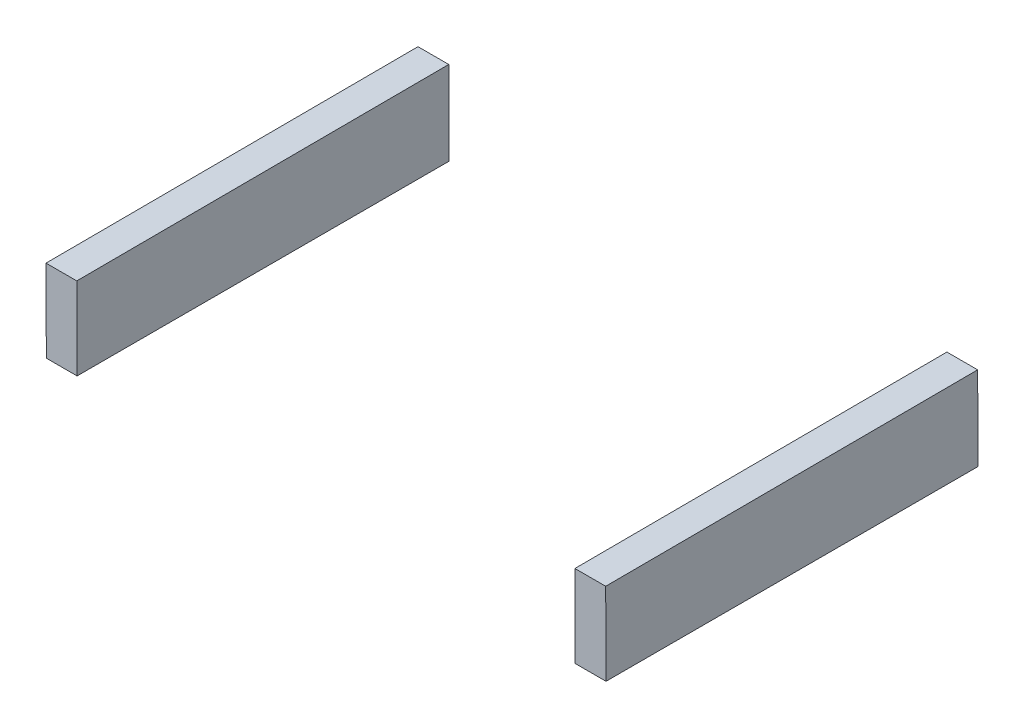
ISO-10303-21;
HEADER;
FILE_DESCRIPTION(('STEP AP214'),'2;1');
FILE_NAME('part.step','',(''),(''),'','','');
FILE_SCHEMA(('AUTOMOTIVE_DESIGN { 1 0 10303 214 1 1 1 1 }'));
ENDSEC;
DATA;
#1=APPLICATION_CONTEXT('core data for automotive mechanical design processes');
#2=APPLICATION_PROTOCOL_DEFINITION('international standard','automotive_design',2000,#1);
#3=PRODUCT_CONTEXT('',#1,'mechanical');
#4=PRODUCT('Part','Part','',(#3));
#5=PRODUCT_RELATED_PRODUCT_CATEGORY('part','',(#4));
#6=PRODUCT_DEFINITION_FORMATION('','',#4);
#7=PRODUCT_DEFINITION_CONTEXT('part definition',#1,'design');
#8=PRODUCT_DEFINITION('design','',#6,#7);
#9=PRODUCT_DEFINITION_SHAPE('','',#8);
#10=(LENGTH_UNIT() NAMED_UNIT(*) SI_UNIT(.MILLI.,.METRE.));
#11=(NAMED_UNIT(*) PLANE_ANGLE_UNIT() SI_UNIT($,.RADIAN.));
#12=(NAMED_UNIT(*) SI_UNIT($,.STERADIAN.) SOLID_ANGLE_UNIT());
#13=UNCERTAINTY_MEASURE_WITH_UNIT(LENGTH_MEASURE(1.E-05),#10,'distance_accuracy_value','');
#14=(GEOMETRIC_REPRESENTATION_CONTEXT(3) GLOBAL_UNCERTAINTY_ASSIGNED_CONTEXT((#13)) GLOBAL_UNIT_ASSIGNED_CONTEXT((#10,
#11,#12)) REPRESENTATION_CONTEXT('',''));
#15=CARTESIAN_POINT('',(0.,0.,0.));
#16=DIRECTION('',(0.,0.,1.));
#17=DIRECTION('',(1.,0.,0.));
#18=AXIS2_PLACEMENT_3D('',#15,#16,#17);
#19=CARTESIAN_POINT('',(0.,71.1662208241946,0.278618565381096));
#20=DIRECTION('',(0.,0.999992336320967,0.00391500949342411));
#21=DIRECTION('',(0.,-0.00391500949342411,0.999992336320967));
#22=AXIS2_PLACEMENT_3D('',#19,#20,#21);
#23=PLANE('',#22);
#24=DIRECTION('',(0.,-0.00391500949342411,0.999992336320967));
#25=VECTOR('',#24,1.);
#26=CARTESIAN_POINT('',(108.267412509275,69.0845166715377,531.998452869963));
#27=LINE('',#26,#25);
#28=CARTESIAN_POINT('',(108.267412509275,69.6049098906345,399.076877112803));
#29=VERTEX_POINT('',#28);
#30=CARTESIAN_POINT('',(108.267412509275,69.0845166715377,531.998452869963));
#31=VERTEX_POINT('',#30);
#32=EDGE_CURVE('E93',#29,#31,#27,.T.);
#33=ORIENTED_EDGE('',*,*,#32,.F.);
#34=DIRECTION('',(1.,0.,0.));
#35=VECTOR('',#34,1.);
#36=CARTESIAN_POINT('',(108.267412509275,69.6049098906345,399.076877112803));
#37=LINE('',#36,#35);
#38=CARTESIAN_POINT('',(97.267412509275,69.6049098906345,399.076877112803));
#39=VERTEX_POINT('',#38);
#40=EDGE_CURVE('E104',#39,#29,#37,.T.);
#41=ORIENTED_EDGE('',*,*,#40,.F.);
#42=DIRECTION('',(0.,0.00391500949342411,-0.999992336320967));
#43=VECTOR('',#42,1.);
#44=CARTESIAN_POINT('',(97.2674125092749,69.0845166715377,531.998452869963));
#45=LINE('',#44,#43);
#46=CARTESIAN_POINT('',(97.2674125092749,69.0845166715377,531.998452869963));
#47=VERTEX_POINT('',#46);
#48=EDGE_CURVE('E95',#47,#39,#45,.T.);
#49=ORIENTED_EDGE('',*,*,#48,.F.);
#50=DIRECTION('',(-1.,0.,0.));
#51=VECTOR('',#50,1.);
#52=CARTESIAN_POINT('',(108.267412509275,69.0845166715377,531.998452869963));
#53=LINE('',#52,#51);
#54=EDGE_CURVE('E85',#31,#47,#53,.T.);
#55=ORIENTED_EDGE('',*,*,#54,.F.);
#56=EDGE_LOOP('',(#33,#41,#49,#55));
#57=FACE_BOUND('',#56,.T.);
#58=ADVANCED_FACE('F43',(#57),#23,.T.);
#59=CARTESIAN_POINT('',(108.267412509275,-93.5115477863383,398.438269738382));
#60=DIRECTION('',(0.,-0.0039150094934241,0.999992336320967));
#61=DIRECTION('',(0.,-0.999992336320967,-0.0039150094934241));
#62=AXIS2_PLACEMENT_3D('',#59,#60,#61);
#63=PLANE('',#62);
#64=DIRECTION('',(0.,0.999992336320967,0.0039150094934241));
#65=VECTOR('',#64,1.);
#66=CARTESIAN_POINT('',(108.267412509275,-93.5115477863383,398.438269738382));
#67=LINE('',#66,#65);
#68=CARTESIAN_POINT('',(108.267412509275,39.6047144668189,398.9594251628));
#69=VERTEX_POINT('',#68);
#70=EDGE_CURVE('E98',#69,#29,#67,.T.);
#71=ORIENTED_EDGE('',*,*,#70,.F.);
#72=DIRECTION('',(-1.,0.,0.));
#73=VECTOR('',#72,1.);
#74=CARTESIAN_POINT('',(108.267412509275,39.6047144668189,398.9594251628));
#75=LINE('',#74,#73);
#76=CARTESIAN_POINT('',(97.267412509275,39.6047144668189,398.9594251628));
#77=VERTEX_POINT('',#76);
#78=EDGE_CURVE('E47',#69,#77,#75,.T.);
#79=ORIENTED_EDGE('',*,*,#78,.T.);
#80=DIRECTION('',(0.,0.999992336320967,0.0039150094934241));
#81=VECTOR('',#80,1.);
#82=CARTESIAN_POINT('',(97.267412509275,-93.5115477863383,398.438269738382));
#83=LINE('',#82,#81);
#84=EDGE_CURVE('E107',#77,#39,#83,.T.);
#85=ORIENTED_EDGE('',*,*,#84,.T.);
#86=ORIENTED_EDGE('',*,*,#40,.T.);
#87=EDGE_LOOP('',(#71,#79,#85,#86));
#88=FACE_BOUND('',#87,.T.);
#89=ADVANCED_FACE('F116',(#88),#63,.F.);
#90=CARTESIAN_POINT('',(97.2674125092749,-94.031941005435,531.359845495542));
#91=DIRECTION('',(1.,0.,0.));
#92=DIRECTION('',(0.,0.,-1.));
#93=AXIS2_PLACEMENT_3D('',#90,#91,#92);
#94=PLANE('',#93);
#95=ORIENTED_EDGE('',*,*,#84,.F.);
#96=DIRECTION('',(0.,0.,1.));
#97=VECTOR('',#96,1.);
#98=CARTESIAN_POINT('',(97.2674125092749,39.6047144668189,531.359845495542));
#99=LINE('',#98,#97);
#100=CARTESIAN_POINT('',(97.2674125092749,39.6047144668189,531.883038279967));
#101=VERTEX_POINT('',#100);
#102=EDGE_CURVE('E113',#77,#101,#99,.T.);
#103=ORIENTED_EDGE('',*,*,#102,.T.);
#104=DIRECTION('',(0.,0.999992336320967,0.0039150094934241));
#105=VECTOR('',#104,1.);
#106=CARTESIAN_POINT('',(97.2674125092749,-94.031941005435,531.359845495542));
#107=LINE('',#106,#105);
#108=EDGE_CURVE('E89',#101,#47,#107,.T.);
#109=ORIENTED_EDGE('',*,*,#108,.T.);
#110=ORIENTED_EDGE('',*,*,#48,.T.);
#111=EDGE_LOOP('',(#95,#103,#109,#110));
#112=FACE_BOUND('',#111,.T.);
#113=ADVANCED_FACE('F112',(#112),#94,.F.);
#114=CARTESIAN_POINT('',(108.267412509275,-94.031941005435,531.359845495542));
#115=DIRECTION('',(0.,0.0039150094934241,-0.999992336320967));
#116=DIRECTION('',(0.,0.999992336320967,0.0039150094934241));
#117=AXIS2_PLACEMENT_3D('',#114,#115,#116);
#118=PLANE('',#117);
#119=ORIENTED_EDGE('',*,*,#108,.F.);
#120=DIRECTION('',(1.,0.,0.));
#121=VECTOR('',#120,1.);
#122=CARTESIAN_POINT('',(108.267412509275,39.6047144668189,531.883038279967));
#123=LINE('',#122,#121);
#124=CARTESIAN_POINT('',(108.267412509275,39.6047144668189,531.883038279967));
#125=VERTEX_POINT('',#124);
#126=EDGE_CURVE('E52',#101,#125,#123,.T.);
#127=ORIENTED_EDGE('',*,*,#126,.T.);
#128=DIRECTION('',(0.,0.999992336320967,0.0039150094934241));
#129=VECTOR('',#128,1.);
#130=CARTESIAN_POINT('',(108.267412509275,-94.031941005435,531.359845495542));
#131=LINE('',#130,#129);
#132=EDGE_CURVE('E82',#125,#31,#131,.T.);
#133=ORIENTED_EDGE('',*,*,#132,.T.);
#134=ORIENTED_EDGE('',*,*,#54,.T.);
#135=EDGE_LOOP('',(#119,#127,#133,#134));
#136=FACE_BOUND('',#135,.T.);
#137=ADVANCED_FACE('F84',(#136),#118,.F.);
#138=CARTESIAN_POINT('',(108.267412509275,-94.031941005435,531.359845495542));
#139=DIRECTION('',(-1.,0.,0.));
#140=DIRECTION('',(0.,0.,1.));
#141=AXIS2_PLACEMENT_3D('',#138,#139,#140);
#142=PLANE('',#141);
#143=ORIENTED_EDGE('',*,*,#132,.F.);
#144=DIRECTION('',(0.,0.,-1.));
#145=VECTOR('',#144,1.);
#146=CARTESIAN_POINT('',(108.267412509275,39.6047144668189,531.359845495542));
#147=LINE('',#146,#145);
#148=EDGE_CURVE('E12',#125,#69,#147,.T.);
#149=ORIENTED_EDGE('',*,*,#148,.T.);
#150=ORIENTED_EDGE('',*,*,#70,.T.);
#151=ORIENTED_EDGE('',*,*,#32,.T.);
#152=EDGE_LOOP('',(#143,#149,#150,#151));
#153=FACE_BOUND('',#152,.T.);
#154=ADVANCED_FACE('F45',(#153),#142,.F.);
#155=CARTESIAN_POINT('',(119.23441331911,39.6047144668191,49.1767098548853));
#156=DIRECTION('',(0.,1.,0.));
#157=DIRECTION('',(-1.,0.,0.));
#158=AXIS2_PLACEMENT_3D('',#155,#156,#157);
#159=PLANE('',#158);
#160=ORIENTED_EDGE('',*,*,#126,.F.);
#161=ORIENTED_EDGE('',*,*,#102,.F.);
#162=ORIENTED_EDGE('',*,*,#78,.F.);
#163=ORIENTED_EDGE('',*,*,#148,.F.);
#164=EDGE_LOOP('',(#160,#161,#162,#163));
#165=FACE_BOUND('',#164,.T.);
#166=ADVANCED_FACE('F130',(#165),#159,.F.);
#167=CLOSED_SHELL('',(#58,#89,#113,#137,#154,#166));
#168=MANIFOLD_SOLID_BREP('B2',#167);
#169=CARTESIAN_POINT('',(0.,71.1662208241946,0.278618565381095));
#170=DIRECTION('',(0.,-0.999992336320967,-0.0039150094934241));
#171=DIRECTION('',(0.,0.0039150094934241,-0.999992336320967));
#172=AXIS2_PLACEMENT_3D('',#169,#170,#171);
#173=PLANE('',#172);
#174=DIRECTION('',(0.,0.0039150094934241,-0.999992336320967));
#175=VECTOR('',#174,1.);
#176=CARTESIAN_POINT('',(-91.7325874907251,69.0845166715378,531.998452869963));
#177=LINE('',#176,#175);
#178=CARTESIAN_POINT('',(-91.7325874907251,69.0845166715378,531.998452869963));
#179=VERTEX_POINT('',#178);
#180=CARTESIAN_POINT('',(-91.7325874907251,69.6049098906345,399.076877112803));
#181=VERTEX_POINT('',#180);
#182=EDGE_CURVE('E217',#179,#181,#177,.T.);
#183=ORIENTED_EDGE('',*,*,#182,.F.);
#184=DIRECTION('',(-1.,0.,0.));
#185=VECTOR('',#184,1.);
#186=CARTESIAN_POINT('',(-91.7325874907251,69.0845166715378,531.998452869963));
#187=LINE('',#186,#185);
#188=CARTESIAN_POINT('',(-80.7325874907251,69.0845166715378,531.998452869963));
#189=VERTEX_POINT('',#188);
#190=EDGE_CURVE('E228',#189,#179,#187,.T.);
#191=ORIENTED_EDGE('',*,*,#190,.F.);
#192=DIRECTION('',(0.,-0.0039150094934241,0.999992336320967));
#193=VECTOR('',#192,1.);
#194=CARTESIAN_POINT('',(-80.7325874907251,69.0845166715378,531.998452869963));
#195=LINE('',#194,#193);
#196=CARTESIAN_POINT('',(-80.7325874907251,69.6049098906345,399.076877112803));
#197=VERTEX_POINT('',#196);
#198=EDGE_CURVE('E219',#197,#189,#195,.T.);
#199=ORIENTED_EDGE('',*,*,#198,.F.);
#200=DIRECTION('',(1.,0.,0.));
#201=VECTOR('',#200,1.);
#202=CARTESIAN_POINT('',(-91.7325874907251,69.6049098906345,399.076877112803));
#203=LINE('',#202,#201);
#204=EDGE_CURVE('E209',#181,#197,#203,.T.);
#205=ORIENTED_EDGE('',*,*,#204,.F.);
#206=EDGE_LOOP('',(#183,#191,#199,#205));
#207=FACE_BOUND('',#206,.T.);
#208=ADVANCED_FACE('F167',(#207),#173,.F.);
#209=CARTESIAN_POINT('',(-91.7325874907251,-94.031941005435,531.359845495542));
#210=DIRECTION('',(0.,0.0039150094934241,-0.999992336320967));
#211=DIRECTION('',(0.,0.999992336320967,0.0039150094934241));
#212=AXIS2_PLACEMENT_3D('',#209,#210,#211);
#213=PLANE('',#212);
#214=DIRECTION('',(0.,0.999992336320967,0.0039150094934241));
#215=VECTOR('',#214,1.);
#216=CARTESIAN_POINT('',(-91.7325874907251,-94.031941005435,531.359845495542));
#217=LINE('',#216,#215);
#218=CARTESIAN_POINT('',(-91.7325874907251,39.6047144668188,531.883038279967));
#219=VERTEX_POINT('',#218);
#220=EDGE_CURVE('E222',#219,#179,#217,.T.);
#221=ORIENTED_EDGE('',*,*,#220,.F.);
#222=DIRECTION('',(1.,0.,0.));
#223=VECTOR('',#222,1.);
#224=CARTESIAN_POINT('',(-91.7325874907251,39.6047144668188,531.883038279967));
#225=LINE('',#224,#223);
#226=CARTESIAN_POINT('',(-80.7325874907251,39.6047144668188,531.883038279967));
#227=VERTEX_POINT('',#226);
#228=EDGE_CURVE('E171',#219,#227,#225,.T.);
#229=ORIENTED_EDGE('',*,*,#228,.T.);
#230=DIRECTION('',(0.,0.999992336320967,0.0039150094934241));
#231=VECTOR('',#230,1.);
#232=CARTESIAN_POINT('',(-80.7325874907251,-94.031941005435,531.359845495542));
#233=LINE('',#232,#231);
#234=EDGE_CURVE('E231',#227,#189,#233,.T.);
#235=ORIENTED_EDGE('',*,*,#234,.T.);
#236=ORIENTED_EDGE('',*,*,#190,.T.);
#237=EDGE_LOOP('',(#221,#229,#235,#236));
#238=FACE_BOUND('',#237,.T.);
#239=ADVANCED_FACE('F240',(#238),#213,.F.);
#240=CARTESIAN_POINT('',(-80.7325874907251,-94.031941005435,531.359845495542));
#241=DIRECTION('',(-1.,0.,0.));
#242=DIRECTION('',(0.,0.,1.));
#243=AXIS2_PLACEMENT_3D('',#240,#241,#242);
#244=PLANE('',#243);
#245=ORIENTED_EDGE('',*,*,#234,.F.);
#246=DIRECTION('',(0.,0.,-1.));
#247=VECTOR('',#246,1.);
#248=CARTESIAN_POINT('',(-80.7325874907251,39.6047144668188,531.359845495542));
#249=LINE('',#248,#247);
#250=CARTESIAN_POINT('',(-80.7325874907251,39.6047144668189,398.9594251628));
#251=VERTEX_POINT('',#250);
#252=EDGE_CURVE('E237',#227,#251,#249,.T.);
#253=ORIENTED_EDGE('',*,*,#252,.T.);
#254=DIRECTION('',(0.,0.999992336320967,0.0039150094934241));
#255=VECTOR('',#254,1.);
#256=CARTESIAN_POINT('',(-80.7325874907251,-93.5115477863382,398.438269738382));
#257=LINE('',#256,#255);
#258=EDGE_CURVE('E213',#251,#197,#257,.T.);
#259=ORIENTED_EDGE('',*,*,#258,.T.);
#260=ORIENTED_EDGE('',*,*,#198,.T.);
#261=EDGE_LOOP('',(#245,#253,#259,#260));
#262=FACE_BOUND('',#261,.T.);
#263=ADVANCED_FACE('F236',(#262),#244,.F.);
#264=CARTESIAN_POINT('',(-91.7325874907251,-93.5115477863382,398.438269738382));
#265=DIRECTION('',(0.,-0.0039150094934241,0.999992336320967));
#266=DIRECTION('',(0.,-0.999992336320967,-0.0039150094934241));
#267=AXIS2_PLACEMENT_3D('',#264,#265,#266);
#268=PLANE('',#267);
#269=ORIENTED_EDGE('',*,*,#258,.F.);
#270=DIRECTION('',(-1.,0.,0.));
#271=VECTOR('',#270,1.);
#272=CARTESIAN_POINT('',(-91.7325874907251,39.6047144668189,398.9594251628));
#273=LINE('',#272,#271);
#274=CARTESIAN_POINT('',(-91.7325874907251,39.6047144668189,398.9594251628));
#275=VERTEX_POINT('',#274);
#276=EDGE_CURVE('E176',#251,#275,#273,.T.);
#277=ORIENTED_EDGE('',*,*,#276,.T.);
#278=DIRECTION('',(0.,0.999992336320967,0.0039150094934241));
#279=VECTOR('',#278,1.);
#280=CARTESIAN_POINT('',(-91.7325874907251,-93.5115477863382,398.438269738382));
#281=LINE('',#280,#279);
#282=EDGE_CURVE('E206',#275,#181,#281,.T.);
#283=ORIENTED_EDGE('',*,*,#282,.T.);
#284=ORIENTED_EDGE('',*,*,#204,.T.);
#285=EDGE_LOOP('',(#269,#277,#283,#284));
#286=FACE_BOUND('',#285,.T.);
#287=ADVANCED_FACE('F208',(#286),#268,.F.);
#288=CARTESIAN_POINT('',(-91.7325874907251,-94.031941005435,531.359845495542));
#289=DIRECTION('',(1.,0.,0.));
#290=DIRECTION('',(0.,0.,-1.));
#291=AXIS2_PLACEMENT_3D('',#288,#289,#290);
#292=PLANE('',#291);
#293=ORIENTED_EDGE('',*,*,#282,.F.);
#294=DIRECTION('',(0.,0.,1.));
#295=VECTOR('',#294,1.);
#296=CARTESIAN_POINT('',(-91.7325874907251,39.6047144668188,531.359845495542));
#297=LINE('',#296,#295);
#298=EDGE_CURVE('E41',#275,#219,#297,.T.);
#299=ORIENTED_EDGE('',*,*,#298,.T.);
#300=ORIENTED_EDGE('',*,*,#220,.T.);
#301=ORIENTED_EDGE('',*,*,#182,.T.);
#302=EDGE_LOOP('',(#293,#299,#300,#301));
#303=FACE_BOUND('',#302,.T.);
#304=ADVANCED_FACE('F169',(#303),#292,.F.);
#305=CARTESIAN_POINT('',(119.23441331911,39.6047144668191,49.1767098548853));
#306=DIRECTION('',(0.,1.,0.));
#307=DIRECTION('',(-1.,0.,0.));
#308=AXIS2_PLACEMENT_3D('',#305,#306,#307);
#309=PLANE('',#308);
#310=ORIENTED_EDGE('',*,*,#276,.F.);
#311=ORIENTED_EDGE('',*,*,#252,.F.);
#312=ORIENTED_EDGE('',*,*,#228,.F.);
#313=ORIENTED_EDGE('',*,*,#298,.F.);
#314=EDGE_LOOP('',(#310,#311,#312,#313));
#315=FACE_BOUND('',#314,.T.);
#316=ADVANCED_FACE('F254',(#315),#309,.F.);
#317=CLOSED_SHELL('',(#208,#239,#263,#287,#304,#316));
#318=MANIFOLD_SOLID_BREP('B6',#317);
#319=ADVANCED_BREP_SHAPE_REPRESENTATION('',(#18,#168,#318),#14);
#320=SHAPE_DEFINITION_REPRESENTATION(#9,#319);
ENDSEC;
END-ISO-10303-21;
